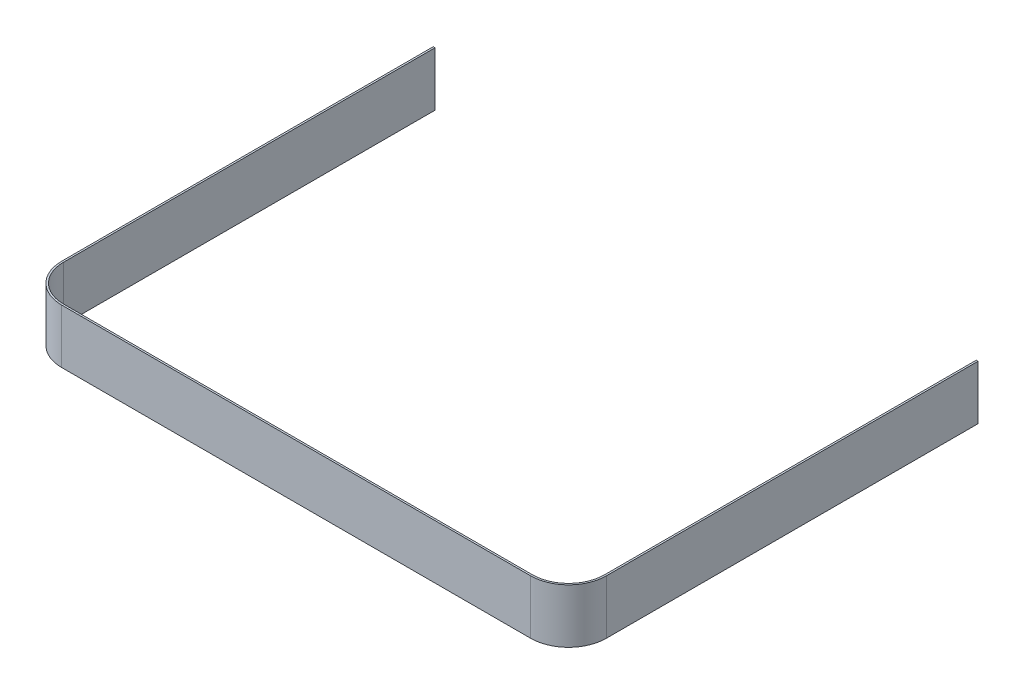
ISO-10303-21;
HEADER;
FILE_DESCRIPTION(('STEP AP214'),'2;1');
FILE_NAME('part.step','',(''),(''),'','','');
FILE_SCHEMA(('AUTOMOTIVE_DESIGN { 1 0 10303 214 1 1 1 1 }'));
ENDSEC;
DATA;
#1=APPLICATION_CONTEXT('core data for automotive mechanical design processes');
#2=APPLICATION_PROTOCOL_DEFINITION('international standard','automotive_design',2000,#1);
#3=PRODUCT_CONTEXT('',#1,'mechanical');
#4=PRODUCT('Part','Part','',(#3));
#5=PRODUCT_RELATED_PRODUCT_CATEGORY('part','',(#4));
#6=PRODUCT_DEFINITION_FORMATION('','',#4);
#7=PRODUCT_DEFINITION_CONTEXT('part definition',#1,'design');
#8=PRODUCT_DEFINITION('design','',#6,#7);
#9=PRODUCT_DEFINITION_SHAPE('','',#8);
#10=(LENGTH_UNIT() NAMED_UNIT(*) SI_UNIT(.MILLI.,.METRE.));
#11=(NAMED_UNIT(*) PLANE_ANGLE_UNIT() SI_UNIT($,.RADIAN.));
#12=(NAMED_UNIT(*) SI_UNIT($,.STERADIAN.) SOLID_ANGLE_UNIT());
#13=UNCERTAINTY_MEASURE_WITH_UNIT(LENGTH_MEASURE(1.E-05),#10,'distance_accuracy_value','');
#14=(GEOMETRIC_REPRESENTATION_CONTEXT(3) GLOBAL_UNCERTAINTY_ASSIGNED_CONTEXT((#13)) GLOBAL_UNIT_ASSIGNED_CONTEXT((#10,
#11,#12)) REPRESENTATION_CONTEXT('',''));
#15=CARTESIAN_POINT('',(0.,0.,0.));
#16=DIRECTION('',(0.,0.,1.));
#17=DIRECTION('',(1.,0.,0.));
#18=AXIS2_PLACEMENT_3D('',#15,#16,#17);
#19=CARTESIAN_POINT('',(150.,30.,55.));
#20=DIRECTION('',(-1.,0.,0.));
#21=DIRECTION('',(0.,0.,1.));
#22=AXIS2_PLACEMENT_3D('',#19,#20,#21);
#23=PLANE('',#22);
#24=DIRECTION('',(0.,0.,-1.));
#25=VECTOR('',#24,1.);
#26=CARTESIAN_POINT('',(150.,0.,55.));
#27=LINE('',#26,#25);
#28=CARTESIAN_POINT('',(150.,0.,55.));
#29=VERTEX_POINT('',#28);
#30=CARTESIAN_POINT('',(150.,0.,-151.));
#31=VERTEX_POINT('',#30);
#32=EDGE_CURVE('E144',#29,#31,#27,.T.);
#33=ORIENTED_EDGE('',*,*,#32,.F.);
#34=DIRECTION('',(0.,-1.,0.));
#35=VECTOR('',#34,1.);
#36=CARTESIAN_POINT('',(150.,30.,55.));
#37=LINE('',#36,#35);
#38=CARTESIAN_POINT('',(150.,30.,55.));
#39=VERTEX_POINT('',#38);
#40=EDGE_CURVE('E11',#39,#29,#37,.T.);
#41=ORIENTED_EDGE('',*,*,#40,.F.);
#42=DIRECTION('',(0.,0.,-1.));
#43=VECTOR('',#42,1.);
#44=CARTESIAN_POINT('',(150.,30.,-150.));
#45=LINE('',#44,#43);
#46=CARTESIAN_POINT('',(150.,30.,-151.));
#47=VERTEX_POINT('',#46);
#48=EDGE_CURVE('E50',#39,#47,#45,.T.);
#49=ORIENTED_EDGE('',*,*,#48,.T.);
#50=DIRECTION('',(0.,-1.,0.));
#51=VECTOR('',#50,1.);
#52=CARTESIAN_POINT('',(150.,30.,-151.));
#53=LINE('',#52,#51);
#54=EDGE_CURVE('E35',#47,#31,#53,.T.);
#55=ORIENTED_EDGE('',*,*,#54,.T.);
#56=EDGE_LOOP('',(#33,#41,#49,#55));
#57=FACE_BOUND('',#56,.T.);
#58=ADVANCED_FACE('F31',(#57),#23,.T.);
#59=CARTESIAN_POINT('',(130.,30.,55.));
#60=DIRECTION('',(0.,-1.,0.));
#61=DIRECTION('',(0.,0.,-1.));
#62=AXIS2_PLACEMENT_3D('',#59,#60,#61);
#63=CYLINDRICAL_SURFACE('',#62,20.);
#64=CARTESIAN_POINT('',(130.,0.,55.));
#65=DIRECTION('',(0.,1.,0.));
#66=DIRECTION('',(0.,0.,1.));
#67=AXIS2_PLACEMENT_3D('',#64,#65,#66);
#68=CIRCLE('',#67,20.);
#69=CARTESIAN_POINT('',(130.,0.,75.));
#70=VERTEX_POINT('',#69);
#71=EDGE_CURVE('E142',#70,#29,#68,.T.);
#72=ORIENTED_EDGE('',*,*,#71,.F.);
#73=DIRECTION('',(0.,-1.,0.));
#74=VECTOR('',#73,1.);
#75=CARTESIAN_POINT('',(130.,30.,75.));
#76=LINE('',#75,#74);
#77=CARTESIAN_POINT('',(130.,30.,75.));
#78=VERTEX_POINT('',#77);
#79=EDGE_CURVE('E41',#78,#70,#76,.T.);
#80=ORIENTED_EDGE('',*,*,#79,.F.);
#81=CARTESIAN_POINT('',(130.,30.,55.));
#82=DIRECTION('',(0.,1.,0.));
#83=DIRECTION('',(0.,0.,1.));
#84=AXIS2_PLACEMENT_3D('',#81,#82,#83);
#85=CIRCLE('',#84,20.);
#86=EDGE_CURVE('E128',#78,#39,#85,.T.);
#87=ORIENTED_EDGE('',*,*,#86,.T.);
#88=ORIENTED_EDGE('',*,*,#40,.T.);
#89=EDGE_LOOP('',(#72,#80,#87,#88));
#90=FACE_BOUND('',#89,.T.);
#91=ADVANCED_FACE('F159',(#90),#63,.F.);
#92=CARTESIAN_POINT('',(0.,30.,75.));
#93=DIRECTION('',(0.,0.,-1.));
#94=DIRECTION('',(-1.,0.,0.));
#95=AXIS2_PLACEMENT_3D('',#92,#93,#94);
#96=PLANE('',#95);
#97=DIRECTION('',(1.,0.,0.));
#98=VECTOR('',#97,1.);
#99=CARTESIAN_POINT('',(0.,0.,75.));
#100=LINE('',#99,#98);
#101=CARTESIAN_POINT('',(-130.,0.,75.));
#102=VERTEX_POINT('',#101);
#103=EDGE_CURVE('E139',#102,#70,#100,.T.);
#104=ORIENTED_EDGE('',*,*,#103,.F.);
#105=DIRECTION('',(0.,-1.,0.));
#106=VECTOR('',#105,1.);
#107=CARTESIAN_POINT('',(-130.,30.,75.));
#108=LINE('',#107,#106);
#109=CARTESIAN_POINT('',(-130.,30.,75.));
#110=VERTEX_POINT('',#109);
#111=EDGE_CURVE('E166',#110,#102,#108,.T.);
#112=ORIENTED_EDGE('',*,*,#111,.F.);
#113=DIRECTION('',(1.,0.,0.));
#114=VECTOR('',#113,1.);
#115=CARTESIAN_POINT('',(0.,30.,75.));
#116=LINE('',#115,#114);
#117=EDGE_CURVE('E109',#110,#78,#116,.T.);
#118=ORIENTED_EDGE('',*,*,#117,.T.);
#119=ORIENTED_EDGE('',*,*,#79,.T.);
#120=EDGE_LOOP('',(#104,#112,#118,#119));
#121=FACE_BOUND('',#120,.T.);
#122=ADVANCED_FACE('F164',(#121),#96,.T.);
#123=CARTESIAN_POINT('',(0.,30.,76.));
#124=DIRECTION('',(0.,0.,-1.));
#125=DIRECTION('',(-1.,0.,0.));
#126=AXIS2_PLACEMENT_3D('',#123,#124,#125);
#127=PLANE('',#126);
#128=DIRECTION('',(1.,0.,0.));
#129=VECTOR('',#128,1.);
#130=CARTESIAN_POINT('',(0.,0.,76.));
#131=LINE('',#130,#129);
#132=CARTESIAN_POINT('',(-130.,0.,76.));
#133=VERTEX_POINT('',#132);
#134=CARTESIAN_POINT('',(130.,0.,76.));
#135=VERTEX_POINT('',#134);
#136=EDGE_CURVE('E115',#133,#135,#131,.T.);
#137=ORIENTED_EDGE('',*,*,#136,.T.);
#138=DIRECTION('',(0.,-1.,0.));
#139=VECTOR('',#138,1.);
#140=CARTESIAN_POINT('',(130.,30.,76.));
#141=LINE('',#140,#139);
#142=CARTESIAN_POINT('',(130.,30.,76.));
#143=VERTEX_POINT('',#142);
#144=EDGE_CURVE('E112',#143,#135,#141,.T.);
#145=ORIENTED_EDGE('',*,*,#144,.F.);
#146=DIRECTION('',(1.,0.,0.));
#147=VECTOR('',#146,1.);
#148=CARTESIAN_POINT('',(0.,30.,76.));
#149=LINE('',#148,#147);
#150=CARTESIAN_POINT('',(-130.,30.,76.));
#151=VERTEX_POINT('',#150);
#152=EDGE_CURVE('E96',#151,#143,#149,.T.);
#153=ORIENTED_EDGE('',*,*,#152,.F.);
#154=DIRECTION('',(0.,-1.,0.));
#155=VECTOR('',#154,1.);
#156=CARTESIAN_POINT('',(-130.,30.,76.));
#157=LINE('',#156,#155);
#158=EDGE_CURVE('E173',#151,#133,#157,.T.);
#159=ORIENTED_EDGE('',*,*,#158,.T.);
#160=EDGE_LOOP('',(#137,#145,#153,#159));
#161=FACE_BOUND('',#160,.T.);
#162=ADVANCED_FACE('F113',(#161),#127,.F.);
#163=CARTESIAN_POINT('',(130.,30.,55.));
#164=DIRECTION('',(0.,-1.,0.));
#165=DIRECTION('',(0.,0.,-1.));
#166=AXIS2_PLACEMENT_3D('',#163,#164,#165);
#167=CYLINDRICAL_SURFACE('',#166,21.);
#168=CARTESIAN_POINT('',(130.,0.,55.));
#169=DIRECTION('',(0.,-1.,0.));
#170=DIRECTION('',(1.,0.,0.));
#171=AXIS2_PLACEMENT_3D('',#168,#169,#170);
#172=CIRCLE('',#171,21.);
#173=CARTESIAN_POINT('',(151.,0.,55.));
#174=VERTEX_POINT('',#173);
#175=EDGE_CURVE('E136',#135,#174,#172,.F.);
#176=ORIENTED_EDGE('',*,*,#175,.T.);
#177=DIRECTION('',(0.,-1.,0.));
#178=VECTOR('',#177,1.);
#179=CARTESIAN_POINT('',(151.,30.,55.));
#180=LINE('',#179,#178);
#181=CARTESIAN_POINT('',(151.,30.,55.));
#182=VERTEX_POINT('',#181);
#183=EDGE_CURVE('E118',#182,#174,#180,.T.);
#184=ORIENTED_EDGE('',*,*,#183,.F.);
#185=CARTESIAN_POINT('',(130.,30.,55.));
#186=DIRECTION('',(0.,-1.,0.));
#187=DIRECTION('',(1.,0.,0.));
#188=AXIS2_PLACEMENT_3D('',#185,#186,#187);
#189=CIRCLE('',#188,21.);
#190=EDGE_CURVE('E100',#143,#182,#189,.F.);
#191=ORIENTED_EDGE('',*,*,#190,.F.);
#192=ORIENTED_EDGE('',*,*,#144,.T.);
#193=EDGE_LOOP('',(#176,#184,#191,#192));
#194=FACE_BOUND('',#193,.T.);
#195=ADVANCED_FACE('F120',(#194),#167,.T.);
#196=CARTESIAN_POINT('',(151.,30.,55.));
#197=DIRECTION('',(-1.,0.,0.));
#198=DIRECTION('',(0.,0.,1.));
#199=AXIS2_PLACEMENT_3D('',#196,#197,#198);
#200=PLANE('',#199);
#201=DIRECTION('',(0.,0.,1.));
#202=VECTOR('',#201,1.);
#203=CARTESIAN_POINT('',(151.,0.,55.));
#204=LINE('',#203,#202);
#205=CARTESIAN_POINT('',(151.,0.,-151.));
#206=VERTEX_POINT('',#205);
#207=EDGE_CURVE('E133',#174,#206,#204,.F.);
#208=ORIENTED_EDGE('',*,*,#207,.T.);
#209=DIRECTION('',(0.,-1.,0.));
#210=VECTOR('',#209,1.);
#211=CARTESIAN_POINT('',(151.,30.,-151.));
#212=LINE('',#211,#210);
#213=CARTESIAN_POINT('',(151.,30.,-151.));
#214=VERTEX_POINT('',#213);
#215=EDGE_CURVE('E147',#214,#206,#212,.T.);
#216=ORIENTED_EDGE('',*,*,#215,.F.);
#217=DIRECTION('',(0.,0.,1.));
#218=VECTOR('',#217,1.);
#219=CARTESIAN_POINT('',(151.,30.,-150.));
#220=LINE('',#219,#218);
#221=EDGE_CURVE('E122',#182,#214,#220,.F.);
#222=ORIENTED_EDGE('',*,*,#221,.F.);
#223=ORIENTED_EDGE('',*,*,#183,.T.);
#224=EDGE_LOOP('',(#208,#216,#222,#223));
#225=FACE_BOUND('',#224,.T.);
#226=ADVANCED_FACE('F249',(#225),#200,.F.);
#227=CARTESIAN_POINT('',(151.,30.,-151.));
#228=DIRECTION('',(0.,0.,1.));
#229=DIRECTION('',(1.,0.,0.));
#230=AXIS2_PLACEMENT_3D('',#227,#228,#229);
#231=PLANE('',#230);
#232=DIRECTION('',(-1.,0.,0.));
#233=VECTOR('',#232,1.);
#234=CARTESIAN_POINT('',(151.,0.,-151.));
#235=LINE('',#234,#233);
#236=EDGE_CURVE('E130',#206,#31,#235,.T.);
#237=ORIENTED_EDGE('',*,*,#236,.T.);
#238=ORIENTED_EDGE('',*,*,#54,.F.);
#239=DIRECTION('',(-1.,0.,0.));
#240=VECTOR('',#239,1.);
#241=CARTESIAN_POINT('',(151.,30.,-151.));
#242=LINE('',#241,#240);
#243=EDGE_CURVE('E83',#214,#47,#242,.T.);
#244=ORIENTED_EDGE('',*,*,#243,.F.);
#245=ORIENTED_EDGE('',*,*,#215,.T.);
#246=EDGE_LOOP('',(#237,#238,#244,#245));
#247=FACE_BOUND('',#246,.T.);
#248=ADVANCED_FACE('F33',(#247),#231,.F.);
#249=CARTESIAN_POINT('',(130.,30.,55.));
#250=DIRECTION('',(0.,-1.,0.));
#251=DIRECTION('',(0.,0.,-1.));
#252=AXIS2_PLACEMENT_3D('',#249,#250,#251);
#253=PLANE('',#252);
#254=ORIENTED_EDGE('',*,*,#48,.F.);
#255=ORIENTED_EDGE('',*,*,#86,.F.);
#256=ORIENTED_EDGE('',*,*,#117,.F.);
#257=CARTESIAN_POINT('',(-130.,30.,55.));
#258=DIRECTION('',(0.,-1.,0.));
#259=DIRECTION('',(0.,0.,1.));
#260=AXIS2_PLACEMENT_3D('',#257,#258,#259);
#261=CIRCLE('',#260,20.);
#262=CARTESIAN_POINT('',(-150.,30.,55.));
#263=VERTEX_POINT('',#262);
#264=EDGE_CURVE('E177',#110,#263,#261,.T.);
#265=ORIENTED_EDGE('',*,*,#264,.T.);
#266=DIRECTION('',(0.,0.,-1.));
#267=VECTOR('',#266,1.);
#268=CARTESIAN_POINT('',(-150.,30.,-150.));
#269=LINE('',#268,#267);
#270=CARTESIAN_POINT('',(-150.,30.,-151.));
#271=VERTEX_POINT('',#270);
#272=EDGE_CURVE('E181',#263,#271,#269,.T.);
#273=ORIENTED_EDGE('',*,*,#272,.T.);
#274=DIRECTION('',(1.,0.,0.));
#275=VECTOR('',#274,1.);
#276=CARTESIAN_POINT('',(-151.,30.,-151.));
#277=LINE('',#276,#275);
#278=CARTESIAN_POINT('',(-151.,30.,-151.));
#279=VERTEX_POINT('',#278);
#280=EDGE_CURVE('E190',#279,#271,#277,.T.);
#281=ORIENTED_EDGE('',*,*,#280,.F.);
#282=DIRECTION('',(0.,0.,1.));
#283=VECTOR('',#282,1.);
#284=CARTESIAN_POINT('',(-151.,30.,55.));
#285=LINE('',#284,#283);
#286=CARTESIAN_POINT('',(-151.,30.,55.));
#287=VERTEX_POINT('',#286);
#288=EDGE_CURVE('E183',#287,#279,#285,.F.);
#289=ORIENTED_EDGE('',*,*,#288,.F.);
#290=CARTESIAN_POINT('',(-130.,30.,55.));
#291=DIRECTION('',(0.,1.,0.));
#292=DIRECTION('',(-1.,0.,0.));
#293=AXIS2_PLACEMENT_3D('',#290,#291,#292);
#294=CIRCLE('',#293,21.);
#295=EDGE_CURVE('E105',#151,#287,#294,.F.);
#296=ORIENTED_EDGE('',*,*,#295,.F.);
#297=ORIENTED_EDGE('',*,*,#152,.T.);
#298=ORIENTED_EDGE('',*,*,#190,.T.);
#299=ORIENTED_EDGE('',*,*,#221,.T.);
#300=ORIENTED_EDGE('',*,*,#243,.T.);
#301=EDGE_LOOP('',(#254,#255,#256,#265,#273,#281,#289,#296,#297,#298,#299,#300));
#302=FACE_BOUND('',#301,.T.);
#303=ADVANCED_FACE('F98',(#302),#253,.F.);
#304=CARTESIAN_POINT('',(130.,0.,55.));
#305=DIRECTION('',(0.,-1.,0.));
#306=DIRECTION('',(0.,0.,-1.));
#307=AXIS2_PLACEMENT_3D('',#304,#305,#306);
#308=PLANE('',#307);
#309=ORIENTED_EDGE('',*,*,#32,.T.);
#310=ORIENTED_EDGE('',*,*,#236,.F.);
#311=ORIENTED_EDGE('',*,*,#207,.F.);
#312=ORIENTED_EDGE('',*,*,#175,.F.);
#313=ORIENTED_EDGE('',*,*,#136,.F.);
#314=CARTESIAN_POINT('',(-130.,0.,55.));
#315=DIRECTION('',(0.,1.,0.));
#316=DIRECTION('',(-1.,0.,0.));
#317=AXIS2_PLACEMENT_3D('',#314,#315,#316);
#318=CIRCLE('',#317,21.);
#319=CARTESIAN_POINT('',(-151.,0.,55.));
#320=VERTEX_POINT('',#319);
#321=EDGE_CURVE('E198',#133,#320,#318,.F.);
#322=ORIENTED_EDGE('',*,*,#321,.T.);
#323=DIRECTION('',(0.,0.,1.));
#324=VECTOR('',#323,1.);
#325=CARTESIAN_POINT('',(-151.,0.,-150.));
#326=LINE('',#325,#324);
#327=CARTESIAN_POINT('',(-151.,0.,-151.));
#328=VERTEX_POINT('',#327);
#329=EDGE_CURVE('E201',#320,#328,#326,.F.);
#330=ORIENTED_EDGE('',*,*,#329,.T.);
#331=DIRECTION('',(1.,0.,0.));
#332=VECTOR('',#331,1.);
#333=CARTESIAN_POINT('',(-151.,0.,-151.));
#334=LINE('',#333,#332);
#335=CARTESIAN_POINT('',(-150.,0.,-151.));
#336=VERTEX_POINT('',#335);
#337=EDGE_CURVE('E185',#328,#336,#334,.T.);
#338=ORIENTED_EDGE('',*,*,#337,.T.);
#339=DIRECTION('',(0.,0.,-1.));
#340=VECTOR('',#339,1.);
#341=CARTESIAN_POINT('',(-150.,0.,55.));
#342=LINE('',#341,#340);
#343=CARTESIAN_POINT('',(-150.,0.,55.));
#344=VERTEX_POINT('',#343);
#345=EDGE_CURVE('E193',#344,#336,#342,.T.);
#346=ORIENTED_EDGE('',*,*,#345,.F.);
#347=CARTESIAN_POINT('',(-130.,0.,55.));
#348=DIRECTION('',(0.,-1.,0.));
#349=DIRECTION('',(0.,0.,1.));
#350=AXIS2_PLACEMENT_3D('',#347,#348,#349);
#351=CIRCLE('',#350,20.);
#352=EDGE_CURVE('E196',#102,#344,#351,.T.);
#353=ORIENTED_EDGE('',*,*,#352,.F.);
#354=ORIENTED_EDGE('',*,*,#103,.T.);
#355=ORIENTED_EDGE('',*,*,#71,.T.);
#356=EDGE_LOOP('',(#309,#310,#311,#312,#313,#322,#330,#338,#346,#353,#354,#355));
#357=FACE_BOUND('',#356,.T.);
#358=ADVANCED_FACE('F157',(#357),#308,.T.);
#359=CARTESIAN_POINT('',(-151.,30.,-151.));
#360=DIRECTION('',(0.,0.,-1.));
#361=DIRECTION('',(-1.,0.,0.));
#362=AXIS2_PLACEMENT_3D('',#359,#360,#361);
#363=PLANE('',#362);
#364=ORIENTED_EDGE('',*,*,#337,.F.);
#365=DIRECTION('',(0.,-1.,0.));
#366=VECTOR('',#365,1.);
#367=CARTESIAN_POINT('',(-151.,30.,-151.));
#368=LINE('',#367,#366);
#369=EDGE_CURVE('E208',#279,#328,#368,.T.);
#370=ORIENTED_EDGE('',*,*,#369,.F.);
#371=ORIENTED_EDGE('',*,*,#280,.T.);
#372=DIRECTION('',(0.,-1.,0.));
#373=VECTOR('',#372,1.);
#374=CARTESIAN_POINT('',(-150.,30.,-151.));
#375=LINE('',#374,#373);
#376=EDGE_CURVE('E134',#271,#336,#375,.T.);
#377=ORIENTED_EDGE('',*,*,#376,.T.);
#378=EDGE_LOOP('',(#364,#370,#371,#377));
#379=FACE_BOUND('',#378,.T.);
#380=ADVANCED_FACE('F228',(#379),#363,.T.);
#381=CARTESIAN_POINT('',(-151.,30.,-150.));
#382=DIRECTION('',(-1.,0.,0.));
#383=DIRECTION('',(0.,0.,1.));
#384=AXIS2_PLACEMENT_3D('',#381,#382,#383);
#385=PLANE('',#384);
#386=ORIENTED_EDGE('',*,*,#329,.F.);
#387=DIRECTION('',(0.,-1.,0.));
#388=VECTOR('',#387,1.);
#389=CARTESIAN_POINT('',(-151.,30.,55.));
#390=LINE('',#389,#388);
#391=EDGE_CURVE('E211',#287,#320,#390,.T.);
#392=ORIENTED_EDGE('',*,*,#391,.F.);
#393=ORIENTED_EDGE('',*,*,#288,.T.);
#394=ORIENTED_EDGE('',*,*,#369,.T.);
#395=EDGE_LOOP('',(#386,#392,#393,#394));
#396=FACE_BOUND('',#395,.T.);
#397=ADVANCED_FACE('F244',(#396),#385,.T.);
#398=CARTESIAN_POINT('',(-130.,30.,55.));
#399=DIRECTION('',(0.,-1.,0.));
#400=DIRECTION('',(0.,0.,-1.));
#401=AXIS2_PLACEMENT_3D('',#398,#399,#400);
#402=CYLINDRICAL_SURFACE('',#401,21.);
#403=ORIENTED_EDGE('',*,*,#321,.F.);
#404=ORIENTED_EDGE('',*,*,#158,.F.);
#405=ORIENTED_EDGE('',*,*,#295,.T.);
#406=ORIENTED_EDGE('',*,*,#391,.T.);
#407=EDGE_LOOP('',(#403,#404,#405,#406));
#408=FACE_BOUND('',#407,.T.);
#409=ADVANCED_FACE('F247',(#408),#402,.T.);
#410=CARTESIAN_POINT('',(-130.,30.,55.));
#411=DIRECTION('',(0.,-1.,0.));
#412=DIRECTION('',(0.,0.,-1.));
#413=AXIS2_PLACEMENT_3D('',#410,#411,#412);
#414=CYLINDRICAL_SURFACE('',#413,20.);
#415=ORIENTED_EDGE('',*,*,#352,.T.);
#416=DIRECTION('',(0.,-1.,0.));
#417=VECTOR('',#416,1.);
#418=CARTESIAN_POINT('',(-150.,30.,55.));
#419=LINE('',#418,#417);
#420=EDGE_CURVE('E174',#263,#344,#419,.T.);
#421=ORIENTED_EDGE('',*,*,#420,.F.);
#422=ORIENTED_EDGE('',*,*,#264,.F.);
#423=ORIENTED_EDGE('',*,*,#111,.T.);
#424=EDGE_LOOP('',(#415,#421,#422,#423));
#425=FACE_BOUND('',#424,.T.);
#426=ADVANCED_FACE('F178',(#425),#414,.F.);
#427=CARTESIAN_POINT('',(-150.,30.,55.));
#428=DIRECTION('',(-1.,0.,0.));
#429=DIRECTION('',(0.,0.,1.));
#430=AXIS2_PLACEMENT_3D('',#427,#428,#429);
#431=PLANE('',#430);
#432=ORIENTED_EDGE('',*,*,#345,.T.);
#433=ORIENTED_EDGE('',*,*,#376,.F.);
#434=ORIENTED_EDGE('',*,*,#272,.F.);
#435=ORIENTED_EDGE('',*,*,#420,.T.);
#436=EDGE_LOOP('',(#432,#433,#434,#435));
#437=FACE_BOUND('',#436,.T.);
#438=ADVANCED_FACE('F220',(#437),#431,.F.);
#439=CLOSED_SHELL('',(#58,#91,#122,#162,#195,#226,#248,#303,#358,#380,#397,#409,#426,#438));
#440=MANIFOLD_SOLID_BREP('B2',#439);
#441=ADVANCED_BREP_SHAPE_REPRESENTATION('',(#18,#440),#14);
#442=SHAPE_DEFINITION_REPRESENTATION(#9,#441);
ENDSEC;
END-ISO-10303-21;
